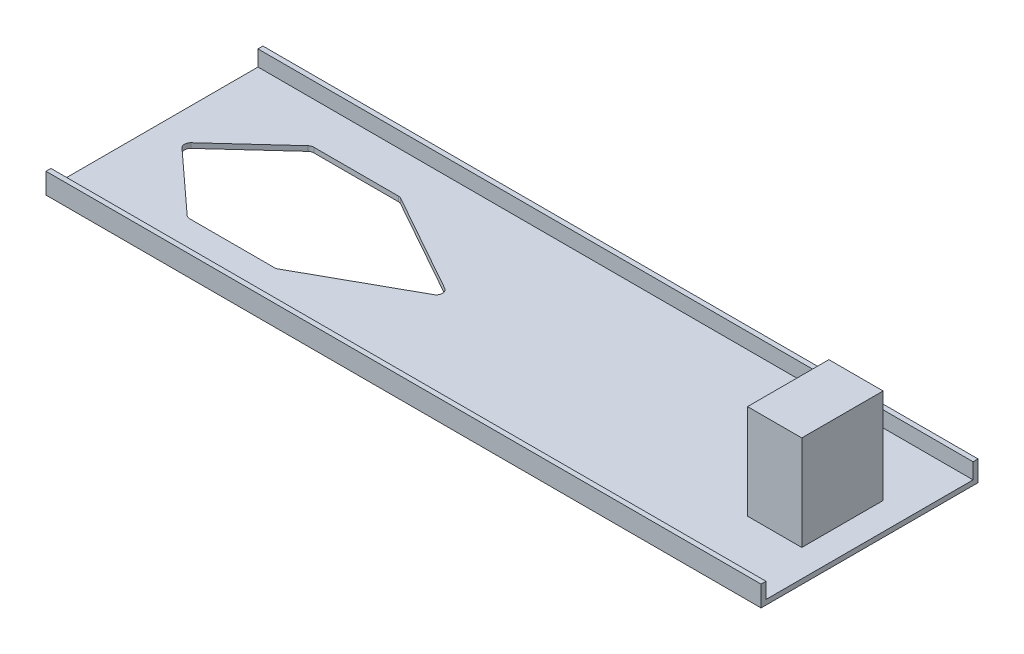
ISO-10303-21;
HEADER;
FILE_DESCRIPTION(('STEP AP214'),'2;1');
FILE_NAME('part.step','',(''),(''),'','','');
FILE_SCHEMA(('AUTOMOTIVE_DESIGN { 1 0 10303 214 1 1 1 1 }'));
ENDSEC;
DATA;
#1=APPLICATION_CONTEXT('core data for automotive mechanical design processes');
#2=APPLICATION_PROTOCOL_DEFINITION('international standard','automotive_design',2000,#1);
#3=PRODUCT_CONTEXT('',#1,'mechanical');
#4=PRODUCT('Part','Part','',(#3));
#5=PRODUCT_RELATED_PRODUCT_CATEGORY('part','',(#4));
#6=PRODUCT_DEFINITION_FORMATION('','',#4);
#7=PRODUCT_DEFINITION_CONTEXT('part definition',#1,'design');
#8=PRODUCT_DEFINITION('design','',#6,#7);
#9=PRODUCT_DEFINITION_SHAPE('','',#8);
#10=(LENGTH_UNIT() NAMED_UNIT(*) SI_UNIT(.MILLI.,.METRE.));
#11=(NAMED_UNIT(*) PLANE_ANGLE_UNIT() SI_UNIT($,.RADIAN.));
#12=(NAMED_UNIT(*) SI_UNIT($,.STERADIAN.) SOLID_ANGLE_UNIT());
#13=UNCERTAINTY_MEASURE_WITH_UNIT(LENGTH_MEASURE(1.E-05),#10,'distance_accuracy_value','');
#14=(GEOMETRIC_REPRESENTATION_CONTEXT(3) GLOBAL_UNCERTAINTY_ASSIGNED_CONTEXT((#13)) GLOBAL_UNIT_ASSIGNED_CONTEXT((#10,
#11,#12)) REPRESENTATION_CONTEXT('',''));
#15=CARTESIAN_POINT('',(0.,0.,0.));
#16=DIRECTION('',(0.,0.,1.));
#17=DIRECTION('',(1.,0.,0.));
#18=AXIS2_PLACEMENT_3D('',#15,#16,#17);
#19=CARTESIAN_POINT('',(0.,4.6228,0.));
#20=DIRECTION('',(0.,-1.,0.));
#21=DIRECTION('',(0.,0.,-1.));
#22=AXIS2_PLACEMENT_3D('',#19,#20,#21);
#23=PLANE('',#22);
#24=DIRECTION('',(1.,0.,0.));
#25=VECTOR('',#24,1.);
#26=CARTESIAN_POINT('',(669.925,4.6228,-198.5772));
#27=LINE('',#26,#25);
#28=CARTESIAN_POINT('',(0.,4.6228,-198.5772));
#29=VERTEX_POINT('',#28);
#30=CARTESIAN_POINT('',(669.925,4.6228,-198.5772));
#31=VERTEX_POINT('',#30);
#32=EDGE_CURVE('E242',#29,#31,#27,.T.);
#33=ORIENTED_EDGE('',*,*,#32,.F.);
#34=DIRECTION('',(0.,0.,1.));
#35=VECTOR('',#34,1.);
#36=CARTESIAN_POINT('',(0.,4.6228,0.));
#37=LINE('',#36,#35);
#38=CARTESIAN_POINT('',(0.,4.6228,-4.6228));
#39=VERTEX_POINT('',#38);
#40=EDGE_CURVE('E295',#29,#39,#37,.T.);
#41=ORIENTED_EDGE('',*,*,#40,.T.);
#42=DIRECTION('',(-1.,0.,0.));
#43=VECTOR('',#42,1.);
#44=CARTESIAN_POINT('',(0.,4.6228,-4.6228));
#45=LINE('',#44,#43);
#46=CARTESIAN_POINT('',(669.925,4.6228,-4.6228));
#47=VERTEX_POINT('',#46);
#48=EDGE_CURVE('E275',#47,#39,#45,.T.);
#49=ORIENTED_EDGE('',*,*,#48,.F.);
#50=DIRECTION('',(0.,0.,-1.));
#51=VECTOR('',#50,1.);
#52=CARTESIAN_POINT('',(669.925,4.6228,0.));
#53=LINE('',#52,#51);
#54=EDGE_CURVE('E297',#47,#31,#53,.T.);
#55=ORIENTED_EDGE('',*,*,#54,.T.);
#56=EDGE_LOOP('',(#33,#41,#49,#55));
#57=FACE_BOUND('',#56,.T.);
#58=DIRECTION('',(-1.,0.,0.));
#59=VECTOR('',#58,1.);
#60=CARTESIAN_POINT('',(171.958,4.6228,-159.7025));
#61=LINE('',#60,#59);
#62=CARTESIAN_POINT('',(170.435524383483,4.6228,-159.7025));
#63=VERTEX_POINT('',#62);
#64=CARTESIAN_POINT('',(91.1693950174015,4.6228,-159.7025));
#65=VERTEX_POINT('',#64);
#66=EDGE_CURVE('E218',#63,#65,#61,.T.);
#67=ORIENTED_EDGE('',*,*,#66,.F.);
#68=CARTESIAN_POINT('',(170.435524383483,4.6228,-153.8605));
#69=DIRECTION('',(0.,-1.,0.));
#70=DIRECTION('',(0.,0.,-1.));
#71=AXIS2_PLACEMENT_3D('',#68,#69,#70);
#72=CIRCLE('',#71,5.842);
#73=CARTESIAN_POINT('',(173.286824285832,4.6228,-158.959426638702));
#74=VERTEX_POINT('',#73);
#75=EDGE_CURVE('E42',#63,#74,#72,.T.);
#76=ORIENTED_EDGE('',*,*,#75,.T.);
#77=DIRECTION('',(-0.872804970678228,0.,-0.488069137683769));
#78=VECTOR('',#77,1.);
#79=CARTESIAN_POINT('',(171.958,4.6228,-159.7025));
#80=LINE('',#79,#78);
#81=CARTESIAN_POINT('',(267.074768519502,4.6228,-106.513573779167));
#82=VERTEX_POINT('',#81);
#83=EDGE_CURVE('E215',#82,#74,#80,.T.);
#84=ORIENTED_EDGE('',*,*,#83,.F.);
#85=CARTESIAN_POINT('',(264.223468617154,4.6228,-101.414647140465));
#86=DIRECTION('',(0.,-1.,0.));
#87=DIRECTION('',(0.,0.,-1.));
#88=AXIS2_PLACEMENT_3D('',#85,#86,#87);
#89=CIRCLE('',#88,5.842);
#90=CARTESIAN_POINT('',(267.059591001054,4.6228,-96.3072628957134));
#91=VERTEX_POINT('',#90);
#92=EDGE_CURVE('E349',#82,#91,#89,.T.);
#93=ORIENTED_EDGE('',*,*,#92,.T.);
#94=DIRECTION('',(0.874252695096158,0.,-0.485471137264724));
#95=VECTOR('',#94,1.);
#96=CARTESIAN_POINT('',(276.225,4.6228,-101.3968));
#97=LINE('',#96,#95);
#98=CARTESIAN_POINT('',(173.280920673522,4.6228,-44.2321157552482));
#99=VERTEX_POINT('',#98);
#100=EDGE_CURVE('E228',#99,#91,#97,.T.);
#101=ORIENTED_EDGE('',*,*,#100,.F.);
#102=CARTESIAN_POINT('',(170.444798289622,4.6228,-49.3394999999999));
#103=DIRECTION('',(0.,-1.,0.));
#104=DIRECTION('',(0.,0.,-1.));
#105=AXIS2_PLACEMENT_3D('',#102,#103,#104);
#106=CIRCLE('',#105,5.842);
#107=CARTESIAN_POINT('',(170.444798289622,4.6228,-43.4974999999999));
#108=VERTEX_POINT('',#107);
#109=EDGE_CURVE('E353',#99,#108,#106,.T.);
#110=ORIENTED_EDGE('',*,*,#109,.T.);
#111=DIRECTION('',(1.,0.,0.));
#112=VECTOR('',#111,1.);
#113=CARTESIAN_POINT('',(171.958,4.6228,-43.4974999999999));
#114=LINE('',#113,#112);
#115=CARTESIAN_POINT('',(91.1693950174015,4.6228,-43.4974999999999));
#116=VERTEX_POINT('',#115);
#117=EDGE_CURVE('E252',#116,#108,#114,.T.);
#118=ORIENTED_EDGE('',*,*,#117,.F.);
#119=CARTESIAN_POINT('',(91.1693950174015,4.6228,-49.3394999999999));
#120=DIRECTION('',(0.,-1.,0.));
#121=DIRECTION('',(0.,0.,-1.));
#122=AXIS2_PLACEMENT_3D('',#119,#120,#121);
#123=CIRCLE('',#122,5.842);
#124=CARTESIAN_POINT('',(87.2257167834106,4.6228,-45.0294691431792));
#125=VERTEX_POINT('',#124);
#126=EDGE_CURVE('E357',#116,#125,#123,.T.);
#127=ORIENTED_EDGE('',*,*,#126,.T.);
#128=DIRECTION('',(0.737766322632775,0.,0.675056185208989));
#129=VECTOR('',#128,1.);
#130=CARTESIAN_POINT('',(25.4,4.6228,-101.6));
#131=LINE('',#130,#129);
#132=CARTESIAN_POINT('',(30.1104162369625,4.6228,-97.2899691431793));
#133=VERTEX_POINT('',#132);
#134=EDGE_CURVE('E249',#133,#125,#131,.T.);
#135=ORIENTED_EDGE('',*,*,#134,.F.);
#136=CARTESIAN_POINT('',(34.0540944709534,4.6228,-101.6));
#137=DIRECTION('',(0.,-1.,0.));
#138=DIRECTION('',(0.,0.,-1.));
#139=AXIS2_PLACEMENT_3D('',#136,#137,#138);
#140=CIRCLE('',#139,5.842);
#141=CARTESIAN_POINT('',(30.1104162369625,4.6228,-105.910030856821));
#142=VERTEX_POINT('',#141);
#143=EDGE_CURVE('E361',#133,#142,#140,.T.);
#144=ORIENTED_EDGE('',*,*,#143,.T.);
#145=DIRECTION('',(-0.737766322632775,0.,0.675056185208989));
#146=VECTOR('',#145,1.);
#147=CARTESIAN_POINT('',(88.9,4.6228,-159.7025));
#148=LINE('',#147,#146);
#149=CARTESIAN_POINT('',(87.2257167834106,4.6228,-158.170530856821));
#150=VERTEX_POINT('',#149);
#151=EDGE_CURVE('E246',#150,#142,#148,.T.);
#152=ORIENTED_EDGE('',*,*,#151,.F.);
#153=CARTESIAN_POINT('',(91.1693950174015,4.6228,-153.8605));
#154=DIRECTION('',(0.,-1.,0.));
#155=DIRECTION('',(0.,0.,-1.));
#156=AXIS2_PLACEMENT_3D('',#153,#154,#155);
#157=CIRCLE('',#156,5.842);
#158=EDGE_CURVE('E365',#150,#65,#157,.T.);
#159=ORIENTED_EDGE('',*,*,#158,.T.);
#160=EDGE_LOOP('',(#67,#76,#84,#93,#101,#110,#118,#127,#135,#144,#152,#159));
#161=FACE_BOUND('',#160,.T.);
#162=DIRECTION('',(0.,0.,-1.));
#163=VECTOR('',#162,1.);
#164=CARTESIAN_POINT('',(644.525,4.6228,-139.7));
#165=LINE('',#164,#163);
#166=CARTESIAN_POINT('',(644.525,4.6228,-63.4999999999999));
#167=VERTEX_POINT('',#166);
#168=CARTESIAN_POINT('',(644.525,4.6228,-139.7));
#169=VERTEX_POINT('',#168);
#170=EDGE_CURVE('E214',#167,#169,#165,.T.);
#171=ORIENTED_EDGE('',*,*,#170,.F.);
#172=DIRECTION('',(1.,0.,0.));
#173=VECTOR('',#172,1.);
#174=CARTESIAN_POINT('',(644.525,4.6228,-63.4999999999999));
#175=LINE('',#174,#173);
#176=CARTESIAN_POINT('',(593.725,4.6228,-63.4999999999999));
#177=VERTEX_POINT('',#176);
#178=EDGE_CURVE('E211',#177,#167,#175,.T.);
#179=ORIENTED_EDGE('',*,*,#178,.F.);
#180=DIRECTION('',(0.,0.,1.));
#181=VECTOR('',#180,1.);
#182=CARTESIAN_POINT('',(593.725,4.6228,-139.7));
#183=LINE('',#182,#181);
#184=CARTESIAN_POINT('',(593.725,4.6228,-139.7));
#185=VERTEX_POINT('',#184);
#186=EDGE_CURVE('E54',#185,#177,#183,.T.);
#187=ORIENTED_EDGE('',*,*,#186,.F.);
#188=DIRECTION('',(-1.,0.,0.));
#189=VECTOR('',#188,1.);
#190=CARTESIAN_POINT('',(644.525,4.6228,-139.7));
#191=LINE('',#190,#189);
#192=EDGE_CURVE('E49',#169,#185,#191,.T.);
#193=ORIENTED_EDGE('',*,*,#192,.F.);
#194=EDGE_LOOP('',(#171,#179,#187,#193));
#195=FACE_BOUND('',#194,.T.);
#196=ADVANCED_FACE('F34',(#57,#161,#195),#23,.F.);
#197=CARTESIAN_POINT('',(0.,4.6228,0.));
#198=DIRECTION('',(1.,0.,0.));
#199=DIRECTION('',(0.,0.,-1.));
#200=AXIS2_PLACEMENT_3D('',#197,#198,#199);
#201=PLANE('',#200);
#202=DIRECTION('',(0.,0.,1.));
#203=VECTOR('',#202,1.);
#204=CARTESIAN_POINT('',(0.,0.,0.));
#205=LINE('',#204,#203);
#206=CARTESIAN_POINT('',(0.,0.,-203.2));
#207=VERTEX_POINT('',#206);
#208=CARTESIAN_POINT('',(0.,0.,0.));
#209=VERTEX_POINT('',#208);
#210=EDGE_CURVE('E294',#207,#209,#205,.T.);
#211=ORIENTED_EDGE('',*,*,#210,.T.);
#212=DIRECTION('',(0.,-1.,0.));
#213=VECTOR('',#212,1.);
#214=CARTESIAN_POINT('',(0.,4.6228,0.));
#215=LINE('',#214,#213);
#216=CARTESIAN_POINT('',(0.,19.3548,0.));
#217=VERTEX_POINT('',#216);
#218=EDGE_CURVE('E316',#217,#209,#215,.T.);
#219=ORIENTED_EDGE('',*,*,#218,.F.);
#220=DIRECTION('',(0.,0.,1.));
#221=VECTOR('',#220,1.);
#222=CARTESIAN_POINT('',(0.,19.3548,0.));
#223=LINE('',#222,#221);
#224=CARTESIAN_POINT('',(0.,19.3548,-4.6228));
#225=VERTEX_POINT('',#224);
#226=EDGE_CURVE('E276',#225,#217,#223,.T.);
#227=ORIENTED_EDGE('',*,*,#226,.F.);
#228=DIRECTION('',(0.,-1.,0.));
#229=VECTOR('',#228,1.);
#230=CARTESIAN_POINT('',(0.,19.3548,-4.6228));
#231=LINE('',#230,#229);
#232=EDGE_CURVE('E286',#225,#39,#231,.T.);
#233=ORIENTED_EDGE('',*,*,#232,.T.);
#234=ORIENTED_EDGE('',*,*,#40,.F.);
#235=DIRECTION('',(0.,-1.,0.));
#236=VECTOR('',#235,1.);
#237=CARTESIAN_POINT('',(0.,19.3548,-198.5772));
#238=LINE('',#237,#236);
#239=CARTESIAN_POINT('',(0.,19.3548,-198.5772));
#240=VERTEX_POINT('',#239);
#241=EDGE_CURVE('E272',#240,#29,#238,.T.);
#242=ORIENTED_EDGE('',*,*,#241,.F.);
#243=DIRECTION('',(0.,0.,1.));
#244=VECTOR('',#243,1.);
#245=CARTESIAN_POINT('',(0.,19.3548,-203.2));
#246=LINE('',#245,#244);
#247=CARTESIAN_POINT('',(0.,19.3548,-203.2));
#248=VERTEX_POINT('',#247);
#249=EDGE_CURVE('E263',#248,#240,#246,.T.);
#250=ORIENTED_EDGE('',*,*,#249,.F.);
#251=DIRECTION('',(0.,-1.,0.));
#252=VECTOR('',#251,1.);
#253=CARTESIAN_POINT('',(0.,4.6228,-203.2));
#254=LINE('',#253,#252);
#255=EDGE_CURVE('E300',#248,#207,#254,.T.);
#256=ORIENTED_EDGE('',*,*,#255,.T.);
#257=EDGE_LOOP('',(#211,#219,#227,#233,#234,#242,#250,#256));
#258=FACE_BOUND('',#257,.T.);
#259=ADVANCED_FACE('F435',(#258),#201,.F.);
#260=CARTESIAN_POINT('',(0.,4.6228,0.));
#261=DIRECTION('',(0.,0.,-1.));
#262=DIRECTION('',(-1.,0.,0.));
#263=AXIS2_PLACEMENT_3D('',#260,#261,#262);
#264=PLANE('',#263);
#265=DIRECTION('',(1.,0.,0.));
#266=VECTOR('',#265,1.);
#267=CARTESIAN_POINT('',(0.,0.,0.));
#268=LINE('',#267,#266);
#269=CARTESIAN_POINT('',(669.925,0.,0.));
#270=VERTEX_POINT('',#269);
#271=EDGE_CURVE('E303',#209,#270,#268,.T.);
#272=ORIENTED_EDGE('',*,*,#271,.T.);
#273=DIRECTION('',(0.,-1.,0.));
#274=VECTOR('',#273,1.);
#275=CARTESIAN_POINT('',(669.925,4.6228,0.));
#276=LINE('',#275,#274);
#277=CARTESIAN_POINT('',(669.925,19.3548,0.));
#278=VERTEX_POINT('',#277);
#279=EDGE_CURVE('E313',#278,#270,#276,.T.);
#280=ORIENTED_EDGE('',*,*,#279,.F.);
#281=DIRECTION('',(1.,0.,0.));
#282=VECTOR('',#281,1.);
#283=CARTESIAN_POINT('',(0.,19.3548,0.));
#284=LINE('',#283,#282);
#285=EDGE_CURVE('E279',#217,#278,#284,.T.);
#286=ORIENTED_EDGE('',*,*,#285,.F.);
#287=ORIENTED_EDGE('',*,*,#218,.T.);
#288=EDGE_LOOP('',(#272,#280,#286,#287));
#289=FACE_BOUND('',#288,.T.);
#290=ADVANCED_FACE('F441',(#289),#264,.F.);
#291=CARTESIAN_POINT('',(669.925,4.6228,0.));
#292=DIRECTION('',(-1.,0.,0.));
#293=DIRECTION('',(0.,0.,1.));
#294=AXIS2_PLACEMENT_3D('',#291,#292,#293);
#295=PLANE('',#294);
#296=DIRECTION('',(0.,0.,-1.));
#297=VECTOR('',#296,1.);
#298=CARTESIAN_POINT('',(669.925,0.,0.));
#299=LINE('',#298,#297);
#300=CARTESIAN_POINT('',(669.925,0.,-203.2));
#301=VERTEX_POINT('',#300);
#302=EDGE_CURVE('E305',#270,#301,#299,.T.);
#303=ORIENTED_EDGE('',*,*,#302,.T.);
#304=DIRECTION('',(0.,-1.,0.));
#305=VECTOR('',#304,1.);
#306=CARTESIAN_POINT('',(669.925,4.6228,-203.2));
#307=LINE('',#306,#305);
#308=CARTESIAN_POINT('',(669.925,19.3548,-203.2));
#309=VERTEX_POINT('',#308);
#310=EDGE_CURVE('E310',#309,#301,#307,.T.);
#311=ORIENTED_EDGE('',*,*,#310,.F.);
#312=DIRECTION('',(0.,0.,-1.));
#313=VECTOR('',#312,1.);
#314=CARTESIAN_POINT('',(669.925,19.3548,-203.2));
#315=LINE('',#314,#313);
#316=CARTESIAN_POINT('',(669.925,19.3548,-198.5772));
#317=VERTEX_POINT('',#316);
#318=EDGE_CURVE('E257',#317,#309,#315,.T.);
#319=ORIENTED_EDGE('',*,*,#318,.F.);
#320=DIRECTION('',(0.,-1.,0.));
#321=VECTOR('',#320,1.);
#322=CARTESIAN_POINT('',(669.925,19.3548,-198.5772));
#323=LINE('',#322,#321);
#324=EDGE_CURVE('E267',#317,#31,#323,.T.);
#325=ORIENTED_EDGE('',*,*,#324,.T.);
#326=ORIENTED_EDGE('',*,*,#54,.F.);
#327=DIRECTION('',(0.,-1.,0.));
#328=VECTOR('',#327,1.);
#329=CARTESIAN_POINT('',(669.925,19.3548,-4.6228));
#330=LINE('',#329,#328);
#331=CARTESIAN_POINT('',(669.925,19.3548,-4.6228));
#332=VERTEX_POINT('',#331);
#333=EDGE_CURVE('E291',#332,#47,#330,.T.);
#334=ORIENTED_EDGE('',*,*,#333,.F.);
#335=DIRECTION('',(0.,0.,-1.));
#336=VECTOR('',#335,1.);
#337=CARTESIAN_POINT('',(669.925,19.3548,0.));
#338=LINE('',#337,#336);
#339=EDGE_CURVE('E282',#278,#332,#338,.T.);
#340=ORIENTED_EDGE('',*,*,#339,.F.);
#341=ORIENTED_EDGE('',*,*,#279,.T.);
#342=EDGE_LOOP('',(#303,#311,#319,#325,#326,#334,#340,#341));
#343=FACE_BOUND('',#342,.T.);
#344=ADVANCED_FACE('F452',(#343),#295,.F.);
#345=CARTESIAN_POINT('',(0.,4.6228,-203.2));
#346=DIRECTION('',(0.,0.,1.));
#347=DIRECTION('',(1.,0.,0.));
#348=AXIS2_PLACEMENT_3D('',#345,#346,#347);
#349=PLANE('',#348);
#350=DIRECTION('',(-1.,0.,0.));
#351=VECTOR('',#350,1.);
#352=CARTESIAN_POINT('',(0.,0.,-203.2));
#353=LINE('',#352,#351);
#354=EDGE_CURVE('E298',#301,#207,#353,.T.);
#355=ORIENTED_EDGE('',*,*,#354,.T.);
#356=ORIENTED_EDGE('',*,*,#255,.F.);
#357=DIRECTION('',(-1.,0.,0.));
#358=VECTOR('',#357,1.);
#359=CARTESIAN_POINT('',(669.925,19.3548,-203.2));
#360=LINE('',#359,#358);
#361=EDGE_CURVE('E260',#309,#248,#360,.T.);
#362=ORIENTED_EDGE('',*,*,#361,.F.);
#363=ORIENTED_EDGE('',*,*,#310,.T.);
#364=EDGE_LOOP('',(#355,#356,#362,#363));
#365=FACE_BOUND('',#364,.T.);
#366=ADVANCED_FACE('F449',(#365),#349,.F.);
#367=CARTESIAN_POINT('',(0.,0.,0.));
#368=DIRECTION('',(0.,-1.,0.));
#369=DIRECTION('',(0.,0.,-1.));
#370=AXIS2_PLACEMENT_3D('',#367,#368,#369);
#371=PLANE('',#370);
#372=DIRECTION('',(0.874252695096158,0.,-0.485471137264724));
#373=VECTOR('',#372,1.);
#374=CARTESIAN_POINT('',(276.225,0.,-101.3968));
#375=LINE('',#374,#373);
#376=CARTESIAN_POINT('',(173.280920673522,0.,-44.2321157552482));
#377=VERTEX_POINT('',#376);
#378=CARTESIAN_POINT('',(267.059591001054,0.,-96.3072628957134));
#379=VERTEX_POINT('',#378);
#380=EDGE_CURVE('E240',#377,#379,#375,.T.);
#381=ORIENTED_EDGE('',*,*,#380,.T.);
#382=CARTESIAN_POINT('',(264.223468617154,0.,-101.414647140465));
#383=DIRECTION('',(0.,-1.,0.));
#384=DIRECTION('',(0.,0.,-1.));
#385=AXIS2_PLACEMENT_3D('',#382,#383,#384);
#386=CIRCLE('',#385,5.842);
#387=CARTESIAN_POINT('',(267.074768519502,0.,-106.513573779167));
#388=VERTEX_POINT('',#387);
#389=EDGE_CURVE('E351',#379,#388,#386,.F.);
#390=ORIENTED_EDGE('',*,*,#389,.T.);
#391=DIRECTION('',(-0.872804970678228,0.,-0.488069137683769));
#392=VECTOR('',#391,1.);
#393=CARTESIAN_POINT('',(171.958,0.,-159.7025));
#394=LINE('',#393,#392);
#395=CARTESIAN_POINT('',(173.286824285832,0.,-158.959426638702));
#396=VERTEX_POINT('',#395);
#397=EDGE_CURVE('E224',#388,#396,#394,.T.);
#398=ORIENTED_EDGE('',*,*,#397,.T.);
#399=CARTESIAN_POINT('',(170.435524383483,0.,-153.8605));
#400=DIRECTION('',(0.,-1.,0.));
#401=DIRECTION('',(0.,0.,-1.));
#402=AXIS2_PLACEMENT_3D('',#399,#400,#401);
#403=CIRCLE('',#402,5.842);
#404=CARTESIAN_POINT('',(170.435524383483,0.,-159.7025));
#405=VERTEX_POINT('',#404);
#406=EDGE_CURVE('E11',#396,#405,#403,.F.);
#407=ORIENTED_EDGE('',*,*,#406,.T.);
#408=DIRECTION('',(-1.,0.,0.));
#409=VECTOR('',#408,1.);
#410=CARTESIAN_POINT('',(171.958,0.,-159.7025));
#411=LINE('',#410,#409);
#412=CARTESIAN_POINT('',(91.1693950174015,0.,-159.7025));
#413=VERTEX_POINT('',#412);
#414=EDGE_CURVE('E227',#405,#413,#411,.T.);
#415=ORIENTED_EDGE('',*,*,#414,.T.);
#416=CARTESIAN_POINT('',(91.1693950174015,0.,-153.8605));
#417=DIRECTION('',(0.,-1.,0.));
#418=DIRECTION('',(0.,0.,-1.));
#419=AXIS2_PLACEMENT_3D('',#416,#417,#418);
#420=CIRCLE('',#419,5.842);
#421=CARTESIAN_POINT('',(87.2257167834106,0.,-158.170530856821));
#422=VERTEX_POINT('',#421);
#423=EDGE_CURVE('E367',#413,#422,#420,.F.);
#424=ORIENTED_EDGE('',*,*,#423,.T.);
#425=DIRECTION('',(-0.737766322632775,0.,0.675056185208989));
#426=VECTOR('',#425,1.);
#427=CARTESIAN_POINT('',(88.9,0.,-159.7025));
#428=LINE('',#427,#426);
#429=CARTESIAN_POINT('',(30.1104162369625,0.,-105.910030856821));
#430=VERTEX_POINT('',#429);
#431=EDGE_CURVE('E231',#422,#430,#428,.T.);
#432=ORIENTED_EDGE('',*,*,#431,.T.);
#433=CARTESIAN_POINT('',(34.0540944709534,0.,-101.6));
#434=DIRECTION('',(0.,-1.,0.));
#435=DIRECTION('',(0.,0.,-1.));
#436=AXIS2_PLACEMENT_3D('',#433,#434,#435);
#437=CIRCLE('',#436,5.842);
#438=CARTESIAN_POINT('',(30.1104162369625,0.,-97.2899691431793));
#439=VERTEX_POINT('',#438);
#440=EDGE_CURVE('E363',#430,#439,#437,.F.);
#441=ORIENTED_EDGE('',*,*,#440,.T.);
#442=DIRECTION('',(0.737766322632775,0.,0.675056185208989));
#443=VECTOR('',#442,1.);
#444=CARTESIAN_POINT('',(25.4,0.,-101.6));
#445=LINE('',#444,#443);
#446=CARTESIAN_POINT('',(87.2257167834106,0.,-45.0294691431792));
#447=VERTEX_POINT('',#446);
#448=EDGE_CURVE('E234',#439,#447,#445,.T.);
#449=ORIENTED_EDGE('',*,*,#448,.T.);
#450=CARTESIAN_POINT('',(91.1693950174015,0.,-49.3394999999999));
#451=DIRECTION('',(0.,-1.,0.));
#452=DIRECTION('',(0.,0.,-1.));
#453=AXIS2_PLACEMENT_3D('',#450,#451,#452);
#454=CIRCLE('',#453,5.842);
#455=CARTESIAN_POINT('',(91.1693950174015,0.,-43.4974999999999));
#456=VERTEX_POINT('',#455);
#457=EDGE_CURVE('E359',#447,#456,#454,.F.);
#458=ORIENTED_EDGE('',*,*,#457,.T.);
#459=DIRECTION('',(1.,0.,0.));
#460=VECTOR('',#459,1.);
#461=CARTESIAN_POINT('',(171.958,0.,-43.4974999999999));
#462=LINE('',#461,#460);
#463=CARTESIAN_POINT('',(170.444798289622,0.,-43.4974999999999));
#464=VERTEX_POINT('',#463);
#465=EDGE_CURVE('E237',#456,#464,#462,.T.);
#466=ORIENTED_EDGE('',*,*,#465,.T.);
#467=CARTESIAN_POINT('',(170.444798289622,0.,-49.3394999999999));
#468=DIRECTION('',(0.,-1.,0.));
#469=DIRECTION('',(0.,0.,-1.));
#470=AXIS2_PLACEMENT_3D('',#467,#468,#469);
#471=CIRCLE('',#470,5.842);
#472=EDGE_CURVE('E355',#464,#377,#471,.F.);
#473=ORIENTED_EDGE('',*,*,#472,.T.);
#474=EDGE_LOOP('',(#381,#390,#398,#407,#415,#424,#432,#441,#449,#458,#466,#473));
#475=FACE_BOUND('',#474,.T.);
#476=ORIENTED_EDGE('',*,*,#210,.F.);
#477=ORIENTED_EDGE('',*,*,#354,.F.);
#478=ORIENTED_EDGE('',*,*,#302,.F.);
#479=ORIENTED_EDGE('',*,*,#271,.F.);
#480=EDGE_LOOP('',(#476,#477,#478,#479));
#481=FACE_BOUND('',#480,.T.);
#482=ADVANCED_FACE('F381',(#475,#481),#371,.T.);
#483=CARTESIAN_POINT('',(0.,19.3548,-4.6228));
#484=DIRECTION('',(0.,0.,1.));
#485=DIRECTION('',(1.,0.,0.));
#486=AXIS2_PLACEMENT_3D('',#483,#484,#485);
#487=PLANE('',#486);
#488=ORIENTED_EDGE('',*,*,#48,.T.);
#489=ORIENTED_EDGE('',*,*,#232,.F.);
#490=DIRECTION('',(-1.,0.,0.));
#491=VECTOR('',#490,1.);
#492=CARTESIAN_POINT('',(0.,19.3548,-4.6228));
#493=LINE('',#492,#491);
#494=EDGE_CURVE('E284',#332,#225,#493,.T.);
#495=ORIENTED_EDGE('',*,*,#494,.F.);
#496=ORIENTED_EDGE('',*,*,#333,.T.);
#497=EDGE_LOOP('',(#488,#489,#495,#496));
#498=FACE_BOUND('',#497,.T.);
#499=ADVANCED_FACE('F445',(#498),#487,.F.);
#500=CARTESIAN_POINT('',(0.,19.3548,0.));
#501=DIRECTION('',(0.,-1.,0.));
#502=DIRECTION('',(0.,0.,-1.));
#503=AXIS2_PLACEMENT_3D('',#500,#501,#502);
#504=PLANE('',#503);
#505=ORIENTED_EDGE('',*,*,#226,.T.);
#506=ORIENTED_EDGE('',*,*,#285,.T.);
#507=ORIENTED_EDGE('',*,*,#339,.T.);
#508=ORIENTED_EDGE('',*,*,#494,.T.);
#509=EDGE_LOOP('',(#505,#506,#507,#508));
#510=FACE_BOUND('',#509,.T.);
#511=ADVANCED_FACE('F484',(#510),#504,.F.);
#512=CARTESIAN_POINT('',(669.925,19.3548,-198.5772));
#513=DIRECTION('',(0.,0.,-1.));
#514=DIRECTION('',(-1.,0.,0.));
#515=AXIS2_PLACEMENT_3D('',#512,#513,#514);
#516=PLANE('',#515);
#517=ORIENTED_EDGE('',*,*,#32,.T.);
#518=ORIENTED_EDGE('',*,*,#324,.F.);
#519=DIRECTION('',(1.,0.,0.));
#520=VECTOR('',#519,1.);
#521=CARTESIAN_POINT('',(669.925,19.3548,-198.5772));
#522=LINE('',#521,#520);
#523=EDGE_CURVE('E265',#240,#317,#522,.T.);
#524=ORIENTED_EDGE('',*,*,#523,.F.);
#525=ORIENTED_EDGE('',*,*,#241,.T.);
#526=EDGE_LOOP('',(#517,#518,#524,#525));
#527=FACE_BOUND('',#526,.T.);
#528=ADVANCED_FACE('F478',(#527),#516,.F.);
#529=CARTESIAN_POINT('',(0.,19.3548,0.));
#530=DIRECTION('',(0.,-1.,0.));
#531=DIRECTION('',(0.,0.,-1.));
#532=AXIS2_PLACEMENT_3D('',#529,#530,#531);
#533=PLANE('',#532);
#534=ORIENTED_EDGE('',*,*,#318,.T.);
#535=ORIENTED_EDGE('',*,*,#361,.T.);
#536=ORIENTED_EDGE('',*,*,#249,.T.);
#537=ORIENTED_EDGE('',*,*,#523,.T.);
#538=EDGE_LOOP('',(#534,#535,#536,#537));
#539=FACE_BOUND('',#538,.T.);
#540=ADVANCED_FACE('F473',(#539),#533,.F.);
#541=CARTESIAN_POINT('',(171.958,0.,-159.7025));
#542=DIRECTION('',(0.488069137683769,0.,-0.872804970678228));
#543=DIRECTION('',(-0.872804970678228,0.,-0.488069137683769));
#544=AXIS2_PLACEMENT_3D('',#541,#542,#543);
#545=PLANE('',#544);
#546=ORIENTED_EDGE('',*,*,#397,.F.);
#547=DIRECTION('',(0.,1.,0.));
#548=VECTOR('',#547,1.);
#549=CARTESIAN_POINT('',(267.074768519502,4.6228,-106.513573779167));
#550=LINE('',#549,#548);
#551=EDGE_CURVE('E321',#388,#82,#550,.T.);
#552=ORIENTED_EDGE('',*,*,#551,.T.);
#553=ORIENTED_EDGE('',*,*,#83,.T.);
#554=DIRECTION('',(0.,1.,0.));
#555=VECTOR('',#554,1.);
#556=CARTESIAN_POINT('',(173.286824285832,0.,-158.959426638702));
#557=LINE('',#556,#555);
#558=EDGE_CURVE('E319',#74,#396,#557,.F.);
#559=ORIENTED_EDGE('',*,*,#558,.T.);
#560=EDGE_LOOP('',(#546,#552,#553,#559));
#561=FACE_BOUND('',#560,.T.);
#562=ADVANCED_FACE('F376',(#561),#545,.F.);
#563=CARTESIAN_POINT('',(276.225,0.,-101.3968));
#564=DIRECTION('',(0.485471137264724,0.,0.874252695096158));
#565=DIRECTION('',(0.874252695096158,0.,-0.485471137264724));
#566=AXIS2_PLACEMENT_3D('',#563,#564,#565);
#567=PLANE('',#566);
#568=ORIENTED_EDGE('',*,*,#100,.T.);
#569=DIRECTION('',(0.,1.,0.));
#570=VECTOR('',#569,1.);
#571=CARTESIAN_POINT('',(267.059591001054,0.,-96.3072628957134));
#572=LINE('',#571,#570);
#573=EDGE_CURVE('E327',#91,#379,#572,.F.);
#574=ORIENTED_EDGE('',*,*,#573,.T.);
#575=ORIENTED_EDGE('',*,*,#380,.F.);
#576=DIRECTION('',(0.,1.,0.));
#577=VECTOR('',#576,1.);
#578=CARTESIAN_POINT('',(173.280920673522,4.6228,-44.2321157552482));
#579=LINE('',#578,#577);
#580=EDGE_CURVE('E324',#377,#99,#579,.T.);
#581=ORIENTED_EDGE('',*,*,#580,.T.);
#582=EDGE_LOOP('',(#568,#574,#575,#581));
#583=FACE_BOUND('',#582,.T.);
#584=ADVANCED_FACE('F420',(#583),#567,.F.);
#585=CARTESIAN_POINT('',(171.958,0.,-43.4974999999999));
#586=DIRECTION('',(0.,0.,1.));
#587=DIRECTION('',(1.,0.,0.));
#588=AXIS2_PLACEMENT_3D('',#585,#586,#587);
#589=PLANE('',#588);
#590=ORIENTED_EDGE('',*,*,#117,.T.);
#591=DIRECTION('',(0.,1.,0.));
#592=VECTOR('',#591,1.);
#593=CARTESIAN_POINT('',(170.444798289622,0.,-43.4974999999999));
#594=LINE('',#593,#592);
#595=EDGE_CURVE('E332',#108,#464,#594,.F.);
#596=ORIENTED_EDGE('',*,*,#595,.T.);
#597=ORIENTED_EDGE('',*,*,#465,.F.);
#598=DIRECTION('',(0.,1.,0.));
#599=VECTOR('',#598,1.);
#600=CARTESIAN_POINT('',(91.1693950174015,4.6228,-43.4974999999999));
#601=LINE('',#600,#599);
#602=EDGE_CURVE('E329',#456,#116,#601,.T.);
#603=ORIENTED_EDGE('',*,*,#602,.T.);
#604=EDGE_LOOP('',(#590,#596,#597,#603));
#605=FACE_BOUND('',#604,.T.);
#606=ADVANCED_FACE('F411',(#605),#589,.F.);
#607=CARTESIAN_POINT('',(25.4,0.,-101.6));
#608=DIRECTION('',(-0.675056185208989,0.,0.737766322632775));
#609=DIRECTION('',(0.737766322632775,0.,0.675056185208989));
#610=AXIS2_PLACEMENT_3D('',#607,#608,#609);
#611=PLANE('',#610);
#612=ORIENTED_EDGE('',*,*,#134,.T.);
#613=DIRECTION('',(0.,1.,0.));
#614=VECTOR('',#613,1.);
#615=CARTESIAN_POINT('',(87.2257167834106,0.,-45.0294691431793));
#616=LINE('',#615,#614);
#617=EDGE_CURVE('E337',#125,#447,#616,.F.);
#618=ORIENTED_EDGE('',*,*,#617,.T.);
#619=ORIENTED_EDGE('',*,*,#448,.F.);
#620=DIRECTION('',(0.,1.,0.));
#621=VECTOR('',#620,1.);
#622=CARTESIAN_POINT('',(30.1104162369625,4.6228,-97.2899691431793));
#623=LINE('',#622,#621);
#624=EDGE_CURVE('E334',#439,#133,#623,.T.);
#625=ORIENTED_EDGE('',*,*,#624,.T.);
#626=EDGE_LOOP('',(#612,#618,#619,#625));
#627=FACE_BOUND('',#626,.T.);
#628=ADVANCED_FACE('F402',(#627),#611,.F.);
#629=CARTESIAN_POINT('',(88.9,0.,-159.7025));
#630=DIRECTION('',(-0.675056185208989,0.,-0.737766322632775));
#631=DIRECTION('',(-0.737766322632775,0.,0.675056185208989));
#632=AXIS2_PLACEMENT_3D('',#629,#630,#631);
#633=PLANE('',#632);
#634=ORIENTED_EDGE('',*,*,#151,.T.);
#635=DIRECTION('',(0.,1.,0.));
#636=VECTOR('',#635,1.);
#637=CARTESIAN_POINT('',(30.1104162369625,0.,-105.910030856821));
#638=LINE('',#637,#636);
#639=EDGE_CURVE('E342',#142,#430,#638,.F.);
#640=ORIENTED_EDGE('',*,*,#639,.T.);
#641=ORIENTED_EDGE('',*,*,#431,.F.);
#642=DIRECTION('',(0.,1.,0.));
#643=VECTOR('',#642,1.);
#644=CARTESIAN_POINT('',(87.2257167834106,4.6228,-158.170530856821));
#645=LINE('',#644,#643);
#646=EDGE_CURVE('E339',#422,#150,#645,.T.);
#647=ORIENTED_EDGE('',*,*,#646,.T.);
#648=EDGE_LOOP('',(#634,#640,#641,#647));
#649=FACE_BOUND('',#648,.T.);
#650=ADVANCED_FACE('F393',(#649),#633,.F.);
#651=CARTESIAN_POINT('',(171.958,0.,-159.7025));
#652=DIRECTION('',(0.,0.,-1.));
#653=DIRECTION('',(-1.,0.,0.));
#654=AXIS2_PLACEMENT_3D('',#651,#652,#653);
#655=PLANE('',#654);
#656=ORIENTED_EDGE('',*,*,#66,.T.);
#657=DIRECTION('',(0.,1.,0.));
#658=VECTOR('',#657,1.);
#659=CARTESIAN_POINT('',(91.1693950174015,0.,-159.7025));
#660=LINE('',#659,#658);
#661=EDGE_CURVE('E347',#65,#413,#660,.F.);
#662=ORIENTED_EDGE('',*,*,#661,.T.);
#663=ORIENTED_EDGE('',*,*,#414,.F.);
#664=DIRECTION('',(0.,1.,0.));
#665=VECTOR('',#664,1.);
#666=CARTESIAN_POINT('',(170.435524383483,4.6228,-159.7025));
#667=LINE('',#666,#665);
#668=EDGE_CURVE('E344',#405,#63,#667,.T.);
#669=ORIENTED_EDGE('',*,*,#668,.T.);
#670=EDGE_LOOP('',(#656,#662,#663,#669));
#671=FACE_BOUND('',#670,.T.);
#672=ADVANCED_FACE('F385',(#671),#655,.F.);
#673=CARTESIAN_POINT('',(264.223468617154,0.,-101.414647140465));
#674=DIRECTION('',(0.,-1.,0.));
#675=DIRECTION('',(0.,0.,-1.));
#676=AXIS2_PLACEMENT_3D('',#673,#674,#675);
#677=CYLINDRICAL_SURFACE('',#676,5.842);
#678=ORIENTED_EDGE('',*,*,#389,.F.);
#679=ORIENTED_EDGE('',*,*,#573,.F.);
#680=ORIENTED_EDGE('',*,*,#92,.F.);
#681=ORIENTED_EDGE('',*,*,#551,.F.);
#682=EDGE_LOOP('',(#678,#679,#680,#681));
#683=FACE_BOUND('',#682,.T.);
#684=ADVANCED_FACE('F424',(#683),#677,.F.);
#685=CARTESIAN_POINT('',(170.444798289622,0.,-49.3394999999999));
#686=DIRECTION('',(0.,-1.,0.));
#687=DIRECTION('',(0.,0.,-1.));
#688=AXIS2_PLACEMENT_3D('',#685,#686,#687);
#689=CYLINDRICAL_SURFACE('',#688,5.842);
#690=ORIENTED_EDGE('',*,*,#472,.F.);
#691=ORIENTED_EDGE('',*,*,#595,.F.);
#692=ORIENTED_EDGE('',*,*,#109,.F.);
#693=ORIENTED_EDGE('',*,*,#580,.F.);
#694=EDGE_LOOP('',(#690,#691,#692,#693));
#695=FACE_BOUND('',#694,.T.);
#696=ADVANCED_FACE('F415',(#695),#689,.F.);
#697=CARTESIAN_POINT('',(91.1693950174015,0.,-49.3394999999999));
#698=DIRECTION('',(0.,-1.,0.));
#699=DIRECTION('',(0.,0.,-1.));
#700=AXIS2_PLACEMENT_3D('',#697,#698,#699);
#701=CYLINDRICAL_SURFACE('',#700,5.842);
#702=ORIENTED_EDGE('',*,*,#457,.F.);
#703=ORIENTED_EDGE('',*,*,#617,.F.);
#704=ORIENTED_EDGE('',*,*,#126,.F.);
#705=ORIENTED_EDGE('',*,*,#602,.F.);
#706=EDGE_LOOP('',(#702,#703,#704,#705));
#707=FACE_BOUND('',#706,.T.);
#708=ADVANCED_FACE('F406',(#707),#701,.F.);
#709=CARTESIAN_POINT('',(34.0540944709534,0.,-101.6));
#710=DIRECTION('',(0.,-1.,0.));
#711=DIRECTION('',(0.,0.,-1.));
#712=AXIS2_PLACEMENT_3D('',#709,#710,#711);
#713=CYLINDRICAL_SURFACE('',#712,5.842);
#714=ORIENTED_EDGE('',*,*,#440,.F.);
#715=ORIENTED_EDGE('',*,*,#639,.F.);
#716=ORIENTED_EDGE('',*,*,#143,.F.);
#717=ORIENTED_EDGE('',*,*,#624,.F.);
#718=EDGE_LOOP('',(#714,#715,#716,#717));
#719=FACE_BOUND('',#718,.T.);
#720=ADVANCED_FACE('F397',(#719),#713,.F.);
#721=CARTESIAN_POINT('',(91.1693950174015,0.,-153.8605));
#722=DIRECTION('',(0.,-1.,0.));
#723=DIRECTION('',(0.,0.,-1.));
#724=AXIS2_PLACEMENT_3D('',#721,#722,#723);
#725=CYLINDRICAL_SURFACE('',#724,5.842);
#726=ORIENTED_EDGE('',*,*,#423,.F.);
#727=ORIENTED_EDGE('',*,*,#661,.F.);
#728=ORIENTED_EDGE('',*,*,#158,.F.);
#729=ORIENTED_EDGE('',*,*,#646,.F.);
#730=EDGE_LOOP('',(#726,#727,#728,#729));
#731=FACE_BOUND('',#730,.T.);
#732=ADVANCED_FACE('F388',(#731),#725,.F.);
#733=CARTESIAN_POINT('',(170.435524383483,0.,-153.8605));
#734=DIRECTION('',(0.,-1.,0.));
#735=DIRECTION('',(0.,0.,-1.));
#736=AXIS2_PLACEMENT_3D('',#733,#734,#735);
#737=CYLINDRICAL_SURFACE('',#736,5.842);
#738=ORIENTED_EDGE('',*,*,#406,.F.);
#739=ORIENTED_EDGE('',*,*,#558,.F.);
#740=ORIENTED_EDGE('',*,*,#75,.F.);
#741=ORIENTED_EDGE('',*,*,#668,.F.);
#742=EDGE_LOOP('',(#738,#739,#740,#741));
#743=FACE_BOUND('',#742,.T.);
#744=ADVANCED_FACE('F36',(#743),#737,.F.);
#745=CARTESIAN_POINT('',(644.525,93.5228,-139.7));
#746=DIRECTION('',(-1.,0.,0.));
#747=DIRECTION('',(0.,0.,1.));
#748=AXIS2_PLACEMENT_3D('',#745,#746,#747);
#749=PLANE('',#748);
#750=ORIENTED_EDGE('',*,*,#170,.T.);
#751=DIRECTION('',(0.,-1.,0.));
#752=VECTOR('',#751,1.);
#753=CARTESIAN_POINT('',(644.525,93.5228,-139.7));
#754=LINE('',#753,#752);
#755=CARTESIAN_POINT('',(644.525,93.5228,-139.7));
#756=VERTEX_POINT('',#755);
#757=EDGE_CURVE('E195',#756,#169,#754,.T.);
#758=ORIENTED_EDGE('',*,*,#757,.F.);
#759=DIRECTION('',(0.,0.,-1.));
#760=VECTOR('',#759,1.);
#761=CARTESIAN_POINT('',(644.525,93.5228,-139.7));
#762=LINE('',#761,#760);
#763=CARTESIAN_POINT('',(644.525,93.5228,-63.4999999999999));
#764=VERTEX_POINT('',#763);
#765=EDGE_CURVE('E202',#764,#756,#762,.T.);
#766=ORIENTED_EDGE('',*,*,#765,.F.);
#767=DIRECTION('',(0.,-1.,0.));
#768=VECTOR('',#767,1.);
#769=CARTESIAN_POINT('',(644.525,93.5228,-63.4999999999999));
#770=LINE('',#769,#768);
#771=EDGE_CURVE('E697',#764,#167,#770,.T.);
#772=ORIENTED_EDGE('',*,*,#771,.T.);
#773=EDGE_LOOP('',(#750,#758,#766,#772));
#774=FACE_BOUND('',#773,.T.);
#775=ADVANCED_FACE('F213',(#774),#749,.F.);
#776=CARTESIAN_POINT('',(644.525,93.5228,-139.7));
#777=DIRECTION('',(0.,0.,1.));
#778=DIRECTION('',(1.,0.,0.));
#779=AXIS2_PLACEMENT_3D('',#776,#777,#778);
#780=PLANE('',#779);
#781=ORIENTED_EDGE('',*,*,#192,.T.);
#782=DIRECTION('',(0.,-1.,0.));
#783=VECTOR('',#782,1.);
#784=CARTESIAN_POINT('',(593.725,93.5228,-139.7));
#785=LINE('',#784,#783);
#786=CARTESIAN_POINT('',(593.725,93.5228,-139.7));
#787=VERTEX_POINT('',#786);
#788=EDGE_CURVE('E198',#787,#185,#785,.T.);
#789=ORIENTED_EDGE('',*,*,#788,.F.);
#790=DIRECTION('',(-1.,0.,0.));
#791=VECTOR('',#790,1.);
#792=CARTESIAN_POINT('',(644.525,93.5228,-139.7));
#793=LINE('',#792,#791);
#794=EDGE_CURVE('E191',#756,#787,#793,.T.);
#795=ORIENTED_EDGE('',*,*,#794,.F.);
#796=ORIENTED_EDGE('',*,*,#757,.T.);
#797=EDGE_LOOP('',(#781,#789,#795,#796));
#798=FACE_BOUND('',#797,.T.);
#799=ADVANCED_FACE('F193',(#798),#780,.F.);
#800=CARTESIAN_POINT('',(593.725,93.5228,-139.7));
#801=DIRECTION('',(1.,0.,0.));
#802=DIRECTION('',(0.,0.,-1.));
#803=AXIS2_PLACEMENT_3D('',#800,#801,#802);
#804=PLANE('',#803);
#805=ORIENTED_EDGE('',*,*,#186,.T.);
#806=DIRECTION('',(0.,-1.,0.));
#807=VECTOR('',#806,1.);
#808=CARTESIAN_POINT('',(593.725,93.5228,-63.4999999999999));
#809=LINE('',#808,#807);
#810=CARTESIAN_POINT('',(593.725,93.5228,-63.4999999999999));
#811=VERTEX_POINT('',#810);
#812=EDGE_CURVE('E220',#811,#177,#809,.T.);
#813=ORIENTED_EDGE('',*,*,#812,.F.);
#814=DIRECTION('',(0.,0.,1.));
#815=VECTOR('',#814,1.);
#816=CARTESIAN_POINT('',(593.725,93.5228,-139.7));
#817=LINE('',#816,#815);
#818=EDGE_CURVE('E201',#787,#811,#817,.T.);
#819=ORIENTED_EDGE('',*,*,#818,.F.);
#820=ORIENTED_EDGE('',*,*,#788,.T.);
#821=EDGE_LOOP('',(#805,#813,#819,#820));
#822=FACE_BOUND('',#821,.T.);
#823=ADVANCED_FACE('F508',(#822),#804,.F.);
#824=CARTESIAN_POINT('',(644.525,93.5228,-63.4999999999999));
#825=DIRECTION('',(0.,0.,-1.));
#826=DIRECTION('',(-1.,0.,0.));
#827=AXIS2_PLACEMENT_3D('',#824,#825,#826);
#828=PLANE('',#827);
#829=ORIENTED_EDGE('',*,*,#178,.T.);
#830=ORIENTED_EDGE('',*,*,#771,.F.);
#831=DIRECTION('',(1.,0.,0.));
#832=VECTOR('',#831,1.);
#833=CARTESIAN_POINT('',(644.525,93.5228,-63.4999999999999));
#834=LINE('',#833,#832);
#835=EDGE_CURVE('E207',#811,#764,#834,.T.);
#836=ORIENTED_EDGE('',*,*,#835,.F.);
#837=ORIENTED_EDGE('',*,*,#812,.T.);
#838=EDGE_LOOP('',(#829,#830,#836,#837));
#839=FACE_BOUND('',#838,.T.);
#840=ADVANCED_FACE('F511',(#839),#828,.F.);
#841=CARTESIAN_POINT('',(0.,93.5228,0.));
#842=DIRECTION('',(0.,-1.,0.));
#843=DIRECTION('',(0.,0.,-1.));
#844=AXIS2_PLACEMENT_3D('',#841,#842,#843);
#845=PLANE('',#844);
#846=ORIENTED_EDGE('',*,*,#765,.T.);
#847=ORIENTED_EDGE('',*,*,#794,.T.);
#848=ORIENTED_EDGE('',*,*,#818,.T.);
#849=ORIENTED_EDGE('',*,*,#835,.T.);
#850=EDGE_LOOP('',(#846,#847,#848,#849));
#851=FACE_BOUND('',#850,.T.);
#852=ADVANCED_FACE('F205',(#851),#845,.F.);
#853=CLOSED_SHELL('',(#196,#259,#290,#344,#366,#482,#499,#511,#528,#540,#562,#584,#606,#628,
#650,#672,#684,#696,#708,#720,#732,#744,#775,#799,#823,#840,#852));
#854=MANIFOLD_SOLID_BREP('B2',#853);
#855=ADVANCED_BREP_SHAPE_REPRESENTATION('',(#18,#854),#14);
#856=SHAPE_DEFINITION_REPRESENTATION(#9,#855);
ENDSEC;
END-ISO-10303-21;
